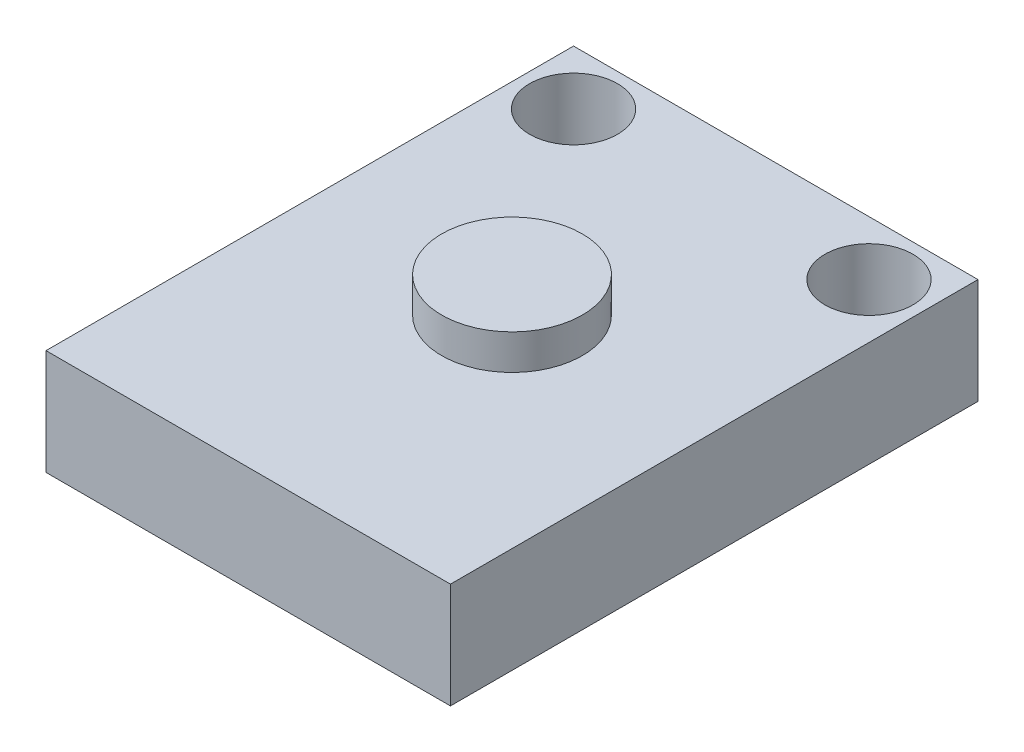
ISO-10303-21;
HEADER;
FILE_DESCRIPTION(('STEP AP214'),'2;1');
FILE_NAME('part.step','',(''),(''),'','','');
FILE_SCHEMA(('AUTOMOTIVE_DESIGN { 1 0 10303 214 1 1 1 1 }'));
ENDSEC;
DATA;
#1=APPLICATION_CONTEXT('core data for automotive mechanical design processes');
#2=APPLICATION_PROTOCOL_DEFINITION('international standard','automotive_design',2000,#1);
#3=PRODUCT_CONTEXT('',#1,'mechanical');
#4=PRODUCT('Part','Part','',(#3));
#5=PRODUCT_RELATED_PRODUCT_CATEGORY('part','',(#4));
#6=PRODUCT_DEFINITION_FORMATION('','',#4);
#7=PRODUCT_DEFINITION_CONTEXT('part definition',#1,'design');
#8=PRODUCT_DEFINITION('design','',#6,#7);
#9=PRODUCT_DEFINITION_SHAPE('','',#8);
#10=(LENGTH_UNIT() NAMED_UNIT(*) SI_UNIT(.MILLI.,.METRE.));
#11=(NAMED_UNIT(*) PLANE_ANGLE_UNIT() SI_UNIT($,.RADIAN.));
#12=(NAMED_UNIT(*) SI_UNIT($,.STERADIAN.) SOLID_ANGLE_UNIT());
#13=UNCERTAINTY_MEASURE_WITH_UNIT(LENGTH_MEASURE(1.E-05),#10,'distance_accuracy_value','');
#14=(GEOMETRIC_REPRESENTATION_CONTEXT(3) GLOBAL_UNCERTAINTY_ASSIGNED_CONTEXT((#13)) GLOBAL_UNIT_ASSIGNED_CONTEXT((#10,
#11,#12)) REPRESENTATION_CONTEXT('',''));
#15=CARTESIAN_POINT('',(0.,0.,0.));
#16=DIRECTION('',(0.,0.,1.));
#17=DIRECTION('',(1.,0.,0.));
#18=AXIS2_PLACEMENT_3D('',#15,#16,#17);
#19=CARTESIAN_POINT('',(0.,6.,0.));
#20=DIRECTION('',(0.,-1.,0.));
#21=DIRECTION('',(0.,0.,-1.));
#22=AXIS2_PLACEMENT_3D('',#19,#20,#21);
#23=PLANE('',#22);
#24=CARTESIAN_POINT('',(0.,6.,0.));
#25=DIRECTION('',(0.,-1.,0.));
#26=DIRECTION('',(0.,0.,-1.));
#27=AXIS2_PLACEMENT_3D('',#24,#25,#26);
#28=CIRCLE('',#27,4.);
#29=CARTESIAN_POINT('',(0.,6.,-4.));
#30=VERTEX_POINT('',#29);
#31=EDGE_CURVE('E122',#30,#30,#28,.T.);
#32=ORIENTED_EDGE('',*,*,#31,.T.);
#33=EDGE_LOOP('',(#32));
#34=FACE_BOUND('',#33,.T.);
#35=DIRECTION('',(0.,0.,-1.));
#36=VECTOR('',#35,1.);
#37=CARTESIAN_POINT('',(11.5,6.,15.));
#38=LINE('',#37,#36);
#39=CARTESIAN_POINT('',(11.5,6.,15.));
#40=VERTEX_POINT('',#39);
#41=CARTESIAN_POINT('',(11.5,6.,-15.));
#42=VERTEX_POINT('',#41);
#43=EDGE_CURVE('E86',#40,#42,#38,.T.);
#44=ORIENTED_EDGE('',*,*,#43,.T.);
#45=DIRECTION('',(-1.,0.,0.));
#46=VECTOR('',#45,1.);
#47=CARTESIAN_POINT('',(-11.5,6.,-15.));
#48=LINE('',#47,#46);
#49=CARTESIAN_POINT('',(-11.5,6.,-15.));
#50=VERTEX_POINT('',#49);
#51=EDGE_CURVE('E81',#42,#50,#48,.T.);
#52=ORIENTED_EDGE('',*,*,#51,.T.);
#53=DIRECTION('',(0.,0.,1.));
#54=VECTOR('',#53,1.);
#55=CARTESIAN_POINT('',(-11.5,6.,15.));
#56=LINE('',#55,#54);
#57=CARTESIAN_POINT('',(-11.5,6.,15.));
#58=VERTEX_POINT('',#57);
#59=EDGE_CURVE('E84',#50,#58,#56,.T.);
#60=ORIENTED_EDGE('',*,*,#59,.T.);
#61=DIRECTION('',(1.,0.,0.));
#62=VECTOR('',#61,1.);
#63=CARTESIAN_POINT('',(-11.5,6.,15.));
#64=LINE('',#63,#62);
#65=EDGE_CURVE('E51',#58,#40,#64,.T.);
#66=ORIENTED_EDGE('',*,*,#65,.T.);
#67=EDGE_LOOP('',(#44,#52,#60,#66));
#68=FACE_BOUND('',#67,.T.);
#69=CARTESIAN_POINT('',(-8.4,6.,-11.9));
#70=DIRECTION('',(0.,1.,0.));
#71=DIRECTION('',(0.,0.,1.));
#72=AXIS2_PLACEMENT_3D('',#69,#70,#71);
#73=CIRCLE('',#72,2.5);
#74=CARTESIAN_POINT('',(-8.4,6.,-9.4));
#75=VERTEX_POINT('',#74);
#76=EDGE_CURVE('E101',#75,#75,#73,.T.);
#77=ORIENTED_EDGE('',*,*,#76,.F.);
#78=EDGE_LOOP('',(#77));
#79=FACE_BOUND('',#78,.T.);
#80=CARTESIAN_POINT('',(8.4,6.,-11.9));
#81=DIRECTION('',(0.,1.,0.));
#82=DIRECTION('',(0.,0.,1.));
#83=AXIS2_PLACEMENT_3D('',#80,#81,#82);
#84=CIRCLE('',#83,2.5);
#85=CARTESIAN_POINT('',(8.4,6.,-9.4));
#86=VERTEX_POINT('',#85);
#87=EDGE_CURVE('E116',#86,#86,#84,.T.);
#88=ORIENTED_EDGE('',*,*,#87,.F.);
#89=EDGE_LOOP('',(#88));
#90=FACE_BOUND('',#89,.T.);
#91=ADVANCED_FACE('F34',(#34,#68,#79,#90),#23,.F.);
#92=CARTESIAN_POINT('',(0.,0.,0.));
#93=DIRECTION('',(0.,-1.,0.));
#94=DIRECTION('',(0.,0.,-1.));
#95=AXIS2_PLACEMENT_3D('',#92,#93,#94);
#96=PLANE('',#95);
#97=CARTESIAN_POINT('',(-8.4,0.,-11.9));
#98=DIRECTION('',(0.,1.,0.));
#99=DIRECTION('',(0.,0.,1.));
#100=AXIS2_PLACEMENT_3D('',#97,#98,#99);
#101=CIRCLE('',#100,2.5);
#102=CARTESIAN_POINT('',(-8.4,0.,-9.4));
#103=VERTEX_POINT('',#102);
#104=EDGE_CURVE('E113',#103,#103,#101,.T.);
#105=ORIENTED_EDGE('',*,*,#104,.T.);
#106=EDGE_LOOP('',(#105));
#107=FACE_BOUND('',#106,.T.);
#108=DIRECTION('',(0.,0.,-1.));
#109=VECTOR('',#108,1.);
#110=CARTESIAN_POINT('',(11.5,0.,15.));
#111=LINE('',#110,#109);
#112=CARTESIAN_POINT('',(11.5,0.,15.));
#113=VERTEX_POINT('',#112);
#114=CARTESIAN_POINT('',(11.5,0.,-15.));
#115=VERTEX_POINT('',#114);
#116=EDGE_CURVE('E98',#113,#115,#111,.T.);
#117=ORIENTED_EDGE('',*,*,#116,.F.);
#118=DIRECTION('',(1.,0.,0.));
#119=VECTOR('',#118,1.);
#120=CARTESIAN_POINT('',(-11.5,0.,15.));
#121=LINE('',#120,#119);
#122=CARTESIAN_POINT('',(-11.5,0.,15.));
#123=VERTEX_POINT('',#122);
#124=EDGE_CURVE('E74',#123,#113,#121,.T.);
#125=ORIENTED_EDGE('',*,*,#124,.F.);
#126=DIRECTION('',(0.,0.,1.));
#127=VECTOR('',#126,1.);
#128=CARTESIAN_POINT('',(-11.5,0.,15.));
#129=LINE('',#128,#127);
#130=CARTESIAN_POINT('',(-11.5,0.,-15.));
#131=VERTEX_POINT('',#130);
#132=EDGE_CURVE('E68',#131,#123,#129,.T.);
#133=ORIENTED_EDGE('',*,*,#132,.F.);
#134=DIRECTION('',(-1.,0.,0.));
#135=VECTOR('',#134,1.);
#136=CARTESIAN_POINT('',(-11.5,0.,-15.));
#137=LINE('',#136,#135);
#138=EDGE_CURVE('E90',#115,#131,#137,.T.);
#139=ORIENTED_EDGE('',*,*,#138,.F.);
#140=EDGE_LOOP('',(#117,#125,#133,#139));
#141=FACE_BOUND('',#140,.T.);
#142=CARTESIAN_POINT('',(8.4,0.,-11.9));
#143=DIRECTION('',(0.,1.,0.));
#144=DIRECTION('',(0.,0.,1.));
#145=AXIS2_PLACEMENT_3D('',#142,#143,#144);
#146=CIRCLE('',#145,2.5);
#147=CARTESIAN_POINT('',(8.4,0.,-9.4));
#148=VERTEX_POINT('',#147);
#149=EDGE_CURVE('E119',#148,#148,#146,.T.);
#150=ORIENTED_EDGE('',*,*,#149,.T.);
#151=EDGE_LOOP('',(#150));
#152=FACE_BOUND('',#151,.T.);
#153=ADVANCED_FACE('F109',(#107,#141,#152),#96,.T.);
#154=CARTESIAN_POINT('',(11.5,6.,15.));
#155=DIRECTION('',(-1.,0.,0.));
#156=DIRECTION('',(0.,0.,1.));
#157=AXIS2_PLACEMENT_3D('',#154,#155,#156);
#158=PLANE('',#157);
#159=ORIENTED_EDGE('',*,*,#116,.T.);
#160=DIRECTION('',(0.,-1.,0.));
#161=VECTOR('',#160,1.);
#162=CARTESIAN_POINT('',(11.5,6.,-15.));
#163=LINE('',#162,#161);
#164=EDGE_CURVE('E11',#42,#115,#163,.T.);
#165=ORIENTED_EDGE('',*,*,#164,.F.);
#166=ORIENTED_EDGE('',*,*,#43,.F.);
#167=DIRECTION('',(0.,-1.,0.));
#168=VECTOR('',#167,1.);
#169=CARTESIAN_POINT('',(11.5,6.,15.));
#170=LINE('',#169,#168);
#171=EDGE_CURVE('E94',#40,#113,#170,.T.);
#172=ORIENTED_EDGE('',*,*,#171,.T.);
#173=EDGE_LOOP('',(#159,#165,#166,#172));
#174=FACE_BOUND('',#173,.T.);
#175=ADVANCED_FACE('F36',(#174),#158,.F.);
#176=CARTESIAN_POINT('',(-11.5,6.,-15.));
#177=DIRECTION('',(0.,0.,1.));
#178=DIRECTION('',(1.,0.,0.));
#179=AXIS2_PLACEMENT_3D('',#176,#177,#178);
#180=PLANE('',#179);
#181=ORIENTED_EDGE('',*,*,#138,.T.);
#182=DIRECTION('',(0.,-1.,0.));
#183=VECTOR('',#182,1.);
#184=CARTESIAN_POINT('',(-11.5,6.,-15.));
#185=LINE('',#184,#183);
#186=EDGE_CURVE('E43',#50,#131,#185,.T.);
#187=ORIENTED_EDGE('',*,*,#186,.F.);
#188=ORIENTED_EDGE('',*,*,#51,.F.);
#189=ORIENTED_EDGE('',*,*,#164,.T.);
#190=EDGE_LOOP('',(#181,#187,#188,#189));
#191=FACE_BOUND('',#190,.T.);
#192=ADVANCED_FACE('F89',(#191),#180,.F.);
#193=CARTESIAN_POINT('',(-11.5,6.,15.));
#194=DIRECTION('',(1.,0.,0.));
#195=DIRECTION('',(0.,0.,-1.));
#196=AXIS2_PLACEMENT_3D('',#193,#194,#195);
#197=PLANE('',#196);
#198=ORIENTED_EDGE('',*,*,#132,.T.);
#199=DIRECTION('',(0.,-1.,0.));
#200=VECTOR('',#199,1.);
#201=CARTESIAN_POINT('',(-11.5,6.,15.));
#202=LINE('',#201,#200);
#203=EDGE_CURVE('E91',#58,#123,#202,.T.);
#204=ORIENTED_EDGE('',*,*,#203,.F.);
#205=ORIENTED_EDGE('',*,*,#59,.F.);
#206=ORIENTED_EDGE('',*,*,#186,.T.);
#207=EDGE_LOOP('',(#198,#204,#205,#206));
#208=FACE_BOUND('',#207,.T.);
#209=ADVANCED_FACE('F92',(#208),#197,.F.);
#210=CARTESIAN_POINT('',(-11.5,6.,15.));
#211=DIRECTION('',(0.,0.,-1.));
#212=DIRECTION('',(-1.,0.,0.));
#213=AXIS2_PLACEMENT_3D('',#210,#211,#212);
#214=PLANE('',#213);
#215=ORIENTED_EDGE('',*,*,#124,.T.);
#216=ORIENTED_EDGE('',*,*,#171,.F.);
#217=ORIENTED_EDGE('',*,*,#65,.F.);
#218=ORIENTED_EDGE('',*,*,#203,.T.);
#219=EDGE_LOOP('',(#215,#216,#217,#218));
#220=FACE_BOUND('',#219,.T.);
#221=ADVANCED_FACE('F106',(#220),#214,.F.);
#222=CARTESIAN_POINT('',(-8.4,6.,-11.9));
#223=DIRECTION('',(0.,-1.,0.));
#224=DIRECTION('',(0.,0.,-1.));
#225=AXIS2_PLACEMENT_3D('',#222,#223,#224);
#226=CYLINDRICAL_SURFACE('',#225,2.5);
#227=ORIENTED_EDGE('',*,*,#76,.T.);
#228=EDGE_LOOP('',(#227));
#229=FACE_BOUND('',#228,.T.);
#230=ORIENTED_EDGE('',*,*,#104,.F.);
#231=EDGE_LOOP('',(#230));
#232=FACE_BOUND('',#231,.T.);
#233=ADVANCED_FACE('F151',(#229,#232),#226,.F.);
#234=CARTESIAN_POINT('',(8.4,6.,-11.9));
#235=DIRECTION('',(0.,-1.,0.));
#236=DIRECTION('',(0.,0.,-1.));
#237=AXIS2_PLACEMENT_3D('',#234,#235,#236);
#238=CYLINDRICAL_SURFACE('',#237,2.5);
#239=ORIENTED_EDGE('',*,*,#87,.T.);
#240=EDGE_LOOP('',(#239));
#241=FACE_BOUND('',#240,.T.);
#242=ORIENTED_EDGE('',*,*,#149,.F.);
#243=EDGE_LOOP('',(#242));
#244=FACE_BOUND('',#243,.T.);
#245=ADVANCED_FACE('F140',(#241,#244),#238,.F.);
#246=CARTESIAN_POINT('',(0.,8.,0.));
#247=DIRECTION('',(0.,-1.,0.));
#248=DIRECTION('',(0.,0.,-1.));
#249=AXIS2_PLACEMENT_3D('',#246,#247,#248);
#250=CYLINDRICAL_SURFACE('',#249,4.);
#251=CARTESIAN_POINT('',(0.,8.,0.));
#252=DIRECTION('',(0.,-1.,0.));
#253=DIRECTION('',(0.,0.,-1.));
#254=AXIS2_PLACEMENT_3D('',#251,#252,#253);
#255=CIRCLE('',#254,4.);
#256=CARTESIAN_POINT('',(0.,8.,-4.));
#257=VERTEX_POINT('',#256);
#258=EDGE_CURVE('E127',#257,#257,#255,.T.);
#259=ORIENTED_EDGE('',*,*,#258,.T.);
#260=EDGE_LOOP('',(#259));
#261=FACE_BOUND('',#260,.T.);
#262=ORIENTED_EDGE('',*,*,#31,.F.);
#263=EDGE_LOOP('',(#262));
#264=FACE_BOUND('',#263,.T.);
#265=ADVANCED_FACE('F131',(#261,#264),#250,.T.);
#266=CARTESIAN_POINT('',(0.,8.,0.));
#267=DIRECTION('',(0.,-1.,0.));
#268=DIRECTION('',(0.,0.,-1.));
#269=AXIS2_PLACEMENT_3D('',#266,#267,#268);
#270=PLANE('',#269);
#271=ORIENTED_EDGE('',*,*,#258,.F.);
#272=EDGE_LOOP('',(#271));
#273=FACE_BOUND('',#272,.T.);
#274=ADVANCED_FACE('F134',(#273),#270,.F.);
#275=CLOSED_SHELL('',(#91,#153,#175,#192,#209,#221,#233,#245,#265,#274));
#276=MANIFOLD_SOLID_BREP('B2',#275);
#277=ADVANCED_BREP_SHAPE_REPRESENTATION('',(#18,#276),#14);
#278=SHAPE_DEFINITION_REPRESENTATION(#9,#277);
ENDSEC;
END-ISO-10303-21;
